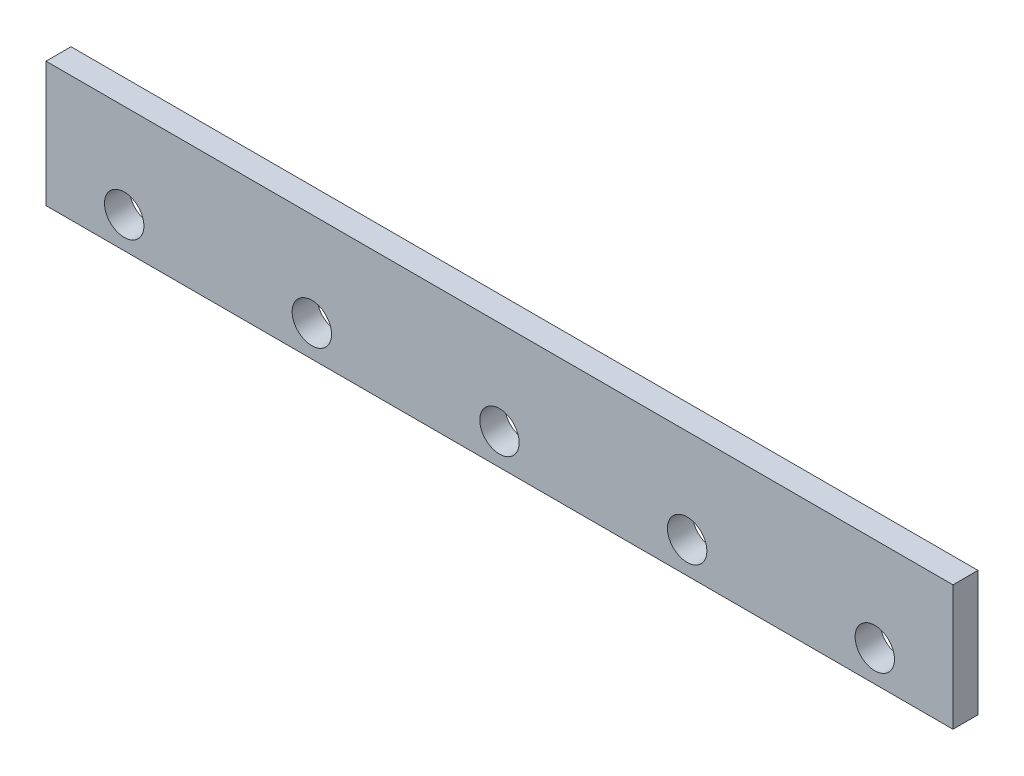
ISO-10303-21;
HEADER;
FILE_DESCRIPTION(('STEP AP214'),'2;1');
FILE_NAME('part.step','',(''),(''),'','','');
FILE_SCHEMA(('AUTOMOTIVE_DESIGN { 1 0 10303 214 1 1 1 1 }'));
ENDSEC;
DATA;
#1=APPLICATION_CONTEXT('core data for automotive mechanical design processes');
#2=APPLICATION_PROTOCOL_DEFINITION('international standard','automotive_design',2000,#1);
#3=PRODUCT_CONTEXT('',#1,'mechanical');
#4=PRODUCT('Part','Part','',(#3));
#5=PRODUCT_RELATED_PRODUCT_CATEGORY('part','',(#4));
#6=PRODUCT_DEFINITION_FORMATION('','',#4);
#7=PRODUCT_DEFINITION_CONTEXT('part definition',#1,'design');
#8=PRODUCT_DEFINITION('design','',#6,#7);
#9=PRODUCT_DEFINITION_SHAPE('','',#8);
#10=(LENGTH_UNIT() NAMED_UNIT(*) SI_UNIT(.MILLI.,.METRE.));
#11=(NAMED_UNIT(*) PLANE_ANGLE_UNIT() SI_UNIT($,.RADIAN.));
#12=(NAMED_UNIT(*) SI_UNIT($,.STERADIAN.) SOLID_ANGLE_UNIT());
#13=UNCERTAINTY_MEASURE_WITH_UNIT(LENGTH_MEASURE(1.E-05),#10,'distance_accuracy_value','');
#14=(GEOMETRIC_REPRESENTATION_CONTEXT(3) GLOBAL_UNCERTAINTY_ASSIGNED_CONTEXT((#13)) GLOBAL_UNIT_ASSIGNED_CONTEXT((#10,
#11,#12)) REPRESENTATION_CONTEXT('',''));
#15=CARTESIAN_POINT('',(0.,0.,0.));
#16=DIRECTION('',(0.,0.,1.));
#17=DIRECTION('',(1.,0.,0.));
#18=AXIS2_PLACEMENT_3D('',#15,#16,#17);
#19=CARTESIAN_POINT('',(0.,0.,16.));
#20=DIRECTION('',(0.,0.,-1.));
#21=DIRECTION('',(-1.,0.,0.));
#22=AXIS2_PLACEMENT_3D('',#19,#20,#21);
#23=PLANE('',#22);
#24=CARTESIAN_POINT('',(410.,20.,16.));
#25=DIRECTION('',(0.,0.,1.));
#26=DIRECTION('',(1.,0.,0.));
#27=AXIS2_PLACEMENT_3D('',#24,#25,#26);
#28=CIRCLE('',#27,12.6);
#29=CARTESIAN_POINT('',(422.6,20.,16.));
#30=VERTEX_POINT('',#29);
#31=EDGE_CURVE('E127',#30,#30,#28,.T.);
#32=ORIENTED_EDGE('',*,*,#31,.F.);
#33=EDGE_LOOP('',(#32));
#34=FACE_BOUND('',#33,.T.);
#35=CARTESIAN_POINT('',(170.,20.,16.));
#36=DIRECTION('',(0.,0.,1.));
#37=DIRECTION('',(1.,0.,0.));
#38=AXIS2_PLACEMENT_3D('',#35,#36,#37);
#39=CIRCLE('',#38,12.6);
#40=CARTESIAN_POINT('',(182.6,20.,16.));
#41=VERTEX_POINT('',#40);
#42=EDGE_CURVE('E115',#41,#41,#39,.T.);
#43=ORIENTED_EDGE('',*,*,#42,.F.);
#44=EDGE_LOOP('',(#43));
#45=FACE_BOUND('',#44,.T.);
#46=DIRECTION('',(0.,-1.,0.));
#47=VECTOR('',#46,1.);
#48=CARTESIAN_POINT('',(0.,0.,16.));
#49=LINE('',#48,#47);
#50=CARTESIAN_POINT('',(0.,80.,16.));
#51=VERTEX_POINT('',#50);
#52=CARTESIAN_POINT('',(0.,0.,16.));
#53=VERTEX_POINT('',#52);
#54=EDGE_CURVE('E85',#51,#53,#49,.T.);
#55=ORIENTED_EDGE('',*,*,#54,.T.);
#56=DIRECTION('',(1.,0.,0.));
#57=VECTOR('',#56,1.);
#58=CARTESIAN_POINT('',(0.,0.,16.));
#59=LINE('',#58,#57);
#60=CARTESIAN_POINT('',(580.,0.,16.));
#61=VERTEX_POINT('',#60);
#62=EDGE_CURVE('E80',#53,#61,#59,.T.);
#63=ORIENTED_EDGE('',*,*,#62,.T.);
#64=DIRECTION('',(0.,1.,0.));
#65=VECTOR('',#64,1.);
#66=CARTESIAN_POINT('',(580.,0.,16.));
#67=LINE('',#66,#65);
#68=CARTESIAN_POINT('',(580.,80.,16.));
#69=VERTEX_POINT('',#68);
#70=EDGE_CURVE('E83',#61,#69,#67,.T.);
#71=ORIENTED_EDGE('',*,*,#70,.T.);
#72=DIRECTION('',(-1.,0.,0.));
#73=VECTOR('',#72,1.);
#74=CARTESIAN_POINT('',(0.,80.,16.));
#75=LINE('',#74,#73);
#76=EDGE_CURVE('E50',#69,#51,#75,.T.);
#77=ORIENTED_EDGE('',*,*,#76,.T.);
#78=EDGE_LOOP('',(#55,#63,#71,#77));
#79=FACE_BOUND('',#78,.T.);
#80=CARTESIAN_POINT('',(50.,20.,16.));
#81=DIRECTION('',(0.,0.,1.));
#82=DIRECTION('',(1.,0.,0.));
#83=AXIS2_PLACEMENT_3D('',#80,#81,#82);
#84=CIRCLE('',#83,12.6);
#85=CARTESIAN_POINT('',(62.6,20.,16.));
#86=VERTEX_POINT('',#85);
#87=EDGE_CURVE('E100',#86,#86,#84,.T.);
#88=ORIENTED_EDGE('',*,*,#87,.F.);
#89=EDGE_LOOP('',(#88));
#90=FACE_BOUND('',#89,.T.);
#91=CARTESIAN_POINT('',(290.,20.,16.));
#92=DIRECTION('',(0.,0.,1.));
#93=DIRECTION('',(1.,0.,0.));
#94=AXIS2_PLACEMENT_3D('',#91,#92,#93);
#95=CIRCLE('',#94,12.6);
#96=CARTESIAN_POINT('',(302.6,20.,16.));
#97=VERTEX_POINT('',#96);
#98=EDGE_CURVE('E121',#97,#97,#95,.T.);
#99=ORIENTED_EDGE('',*,*,#98,.F.);
#100=EDGE_LOOP('',(#99));
#101=FACE_BOUND('',#100,.T.);
#102=CARTESIAN_POINT('',(530.,20.,16.));
#103=DIRECTION('',(0.,0.,1.));
#104=DIRECTION('',(1.,0.,0.));
#105=AXIS2_PLACEMENT_3D('',#102,#103,#104);
#106=CIRCLE('',#105,12.5999999999999);
#107=CARTESIAN_POINT('',(542.6,20.,16.));
#108=VERTEX_POINT('',#107);
#109=EDGE_CURVE('E133',#108,#108,#106,.T.);
#110=ORIENTED_EDGE('',*,*,#109,.F.);
#111=EDGE_LOOP('',(#110));
#112=FACE_BOUND('',#111,.T.);
#113=ADVANCED_FACE('F33',(#34,#45,#79,#90,#101,#112),#23,.F.);
#114=CARTESIAN_POINT('',(0.,0.,0.));
#115=DIRECTION('',(0.,0.,-1.));
#116=DIRECTION('',(-1.,0.,0.));
#117=AXIS2_PLACEMENT_3D('',#114,#115,#116);
#118=PLANE('',#117);
#119=CARTESIAN_POINT('',(410.,20.,0.));
#120=DIRECTION('',(0.,0.,1.));
#121=DIRECTION('',(1.,0.,0.));
#122=AXIS2_PLACEMENT_3D('',#119,#120,#121);
#123=CIRCLE('',#122,12.6);
#124=CARTESIAN_POINT('',(422.6,20.,0.));
#125=VERTEX_POINT('',#124);
#126=EDGE_CURVE('E130',#125,#125,#123,.T.);
#127=ORIENTED_EDGE('',*,*,#126,.T.);
#128=EDGE_LOOP('',(#127));
#129=FACE_BOUND('',#128,.T.);
#130=CARTESIAN_POINT('',(170.,20.,0.));
#131=DIRECTION('',(0.,0.,1.));
#132=DIRECTION('',(1.,0.,0.));
#133=AXIS2_PLACEMENT_3D('',#130,#131,#132);
#134=CIRCLE('',#133,12.6);
#135=CARTESIAN_POINT('',(182.6,20.,0.));
#136=VERTEX_POINT('',#135);
#137=EDGE_CURVE('E118',#136,#136,#134,.T.);
#138=ORIENTED_EDGE('',*,*,#137,.T.);
#139=EDGE_LOOP('',(#138));
#140=FACE_BOUND('',#139,.T.);
#141=DIRECTION('',(0.,-1.,0.));
#142=VECTOR('',#141,1.);
#143=CARTESIAN_POINT('',(0.,0.,0.));
#144=LINE('',#143,#142);
#145=CARTESIAN_POINT('',(0.,80.,0.));
#146=VERTEX_POINT('',#145);
#147=CARTESIAN_POINT('',(0.,0.,0.));
#148=VERTEX_POINT('',#147);
#149=EDGE_CURVE('E97',#146,#148,#144,.T.);
#150=ORIENTED_EDGE('',*,*,#149,.F.);
#151=DIRECTION('',(-1.,0.,0.));
#152=VECTOR('',#151,1.);
#153=CARTESIAN_POINT('',(0.,80.,0.));
#154=LINE('',#153,#152);
#155=CARTESIAN_POINT('',(580.,80.,0.));
#156=VERTEX_POINT('',#155);
#157=EDGE_CURVE('E73',#156,#146,#154,.T.);
#158=ORIENTED_EDGE('',*,*,#157,.F.);
#159=DIRECTION('',(0.,1.,0.));
#160=VECTOR('',#159,1.);
#161=CARTESIAN_POINT('',(580.,0.,0.));
#162=LINE('',#161,#160);
#163=CARTESIAN_POINT('',(580.,0.,0.));
#164=VERTEX_POINT('',#163);
#165=EDGE_CURVE('E67',#164,#156,#162,.T.);
#166=ORIENTED_EDGE('',*,*,#165,.F.);
#167=DIRECTION('',(1.,0.,0.));
#168=VECTOR('',#167,1.);
#169=CARTESIAN_POINT('',(0.,0.,0.));
#170=LINE('',#169,#168);
#171=EDGE_CURVE('E89',#148,#164,#170,.T.);
#172=ORIENTED_EDGE('',*,*,#171,.F.);
#173=EDGE_LOOP('',(#150,#158,#166,#172));
#174=FACE_BOUND('',#173,.T.);
#175=CARTESIAN_POINT('',(50.,20.,0.));
#176=DIRECTION('',(0.,0.,1.));
#177=DIRECTION('',(1.,0.,0.));
#178=AXIS2_PLACEMENT_3D('',#175,#176,#177);
#179=CIRCLE('',#178,12.6);
#180=CARTESIAN_POINT('',(62.6,20.,0.));
#181=VERTEX_POINT('',#180);
#182=EDGE_CURVE('E112',#181,#181,#179,.T.);
#183=ORIENTED_EDGE('',*,*,#182,.T.);
#184=EDGE_LOOP('',(#183));
#185=FACE_BOUND('',#184,.T.);
#186=CARTESIAN_POINT('',(290.,20.,0.));
#187=DIRECTION('',(0.,0.,1.));
#188=DIRECTION('',(1.,0.,0.));
#189=AXIS2_PLACEMENT_3D('',#186,#187,#188);
#190=CIRCLE('',#189,12.6);
#191=CARTESIAN_POINT('',(302.6,20.,0.));
#192=VERTEX_POINT('',#191);
#193=EDGE_CURVE('E124',#192,#192,#190,.T.);
#194=ORIENTED_EDGE('',*,*,#193,.T.);
#195=EDGE_LOOP('',(#194));
#196=FACE_BOUND('',#195,.T.);
#197=CARTESIAN_POINT('',(530.,20.,0.));
#198=DIRECTION('',(0.,0.,1.));
#199=DIRECTION('',(1.,0.,0.));
#200=AXIS2_PLACEMENT_3D('',#197,#198,#199);
#201=CIRCLE('',#200,12.5999999999999);
#202=CARTESIAN_POINT('',(542.6,20.,0.));
#203=VERTEX_POINT('',#202);
#204=EDGE_CURVE('E136',#203,#203,#201,.T.);
#205=ORIENTED_EDGE('',*,*,#204,.T.);
#206=EDGE_LOOP('',(#205));
#207=FACE_BOUND('',#206,.T.);
#208=ADVANCED_FACE('F108',(#129,#140,#174,#185,#196,#207),#118,.T.);
#209=CARTESIAN_POINT('',(0.,0.,16.));
#210=DIRECTION('',(1.,0.,0.));
#211=DIRECTION('',(0.,0.,-1.));
#212=AXIS2_PLACEMENT_3D('',#209,#210,#211);
#213=PLANE('',#212);
#214=ORIENTED_EDGE('',*,*,#149,.T.);
#215=DIRECTION('',(0.,0.,-1.));
#216=VECTOR('',#215,1.);
#217=CARTESIAN_POINT('',(0.,0.,16.));
#218=LINE('',#217,#216);
#219=EDGE_CURVE('E11',#53,#148,#218,.T.);
#220=ORIENTED_EDGE('',*,*,#219,.F.);
#221=ORIENTED_EDGE('',*,*,#54,.F.);
#222=DIRECTION('',(0.,0.,-1.));
#223=VECTOR('',#222,1.);
#224=CARTESIAN_POINT('',(0.,80.,16.));
#225=LINE('',#224,#223);
#226=EDGE_CURVE('E93',#51,#146,#225,.T.);
#227=ORIENTED_EDGE('',*,*,#226,.T.);
#228=EDGE_LOOP('',(#214,#220,#221,#227));
#229=FACE_BOUND('',#228,.T.);
#230=ADVANCED_FACE('F35',(#229),#213,.F.);
#231=CARTESIAN_POINT('',(0.,0.,16.));
#232=DIRECTION('',(0.,1.,0.));
#233=DIRECTION('',(0.,0.,1.));
#234=AXIS2_PLACEMENT_3D('',#231,#232,#233);
#235=PLANE('',#234);
#236=ORIENTED_EDGE('',*,*,#171,.T.);
#237=DIRECTION('',(0.,0.,-1.));
#238=VECTOR('',#237,1.);
#239=CARTESIAN_POINT('',(580.,0.,16.));
#240=LINE('',#239,#238);
#241=EDGE_CURVE('E42',#61,#164,#240,.T.);
#242=ORIENTED_EDGE('',*,*,#241,.F.);
#243=ORIENTED_EDGE('',*,*,#62,.F.);
#244=ORIENTED_EDGE('',*,*,#219,.T.);
#245=EDGE_LOOP('',(#236,#242,#243,#244));
#246=FACE_BOUND('',#245,.T.);
#247=ADVANCED_FACE('F88',(#246),#235,.F.);
#248=CARTESIAN_POINT('',(580.,0.,16.));
#249=DIRECTION('',(-1.,0.,0.));
#250=DIRECTION('',(0.,0.,1.));
#251=AXIS2_PLACEMENT_3D('',#248,#249,#250);
#252=PLANE('',#251);
#253=ORIENTED_EDGE('',*,*,#165,.T.);
#254=DIRECTION('',(0.,0.,-1.));
#255=VECTOR('',#254,1.);
#256=CARTESIAN_POINT('',(580.,80.,16.));
#257=LINE('',#256,#255);
#258=EDGE_CURVE('E90',#69,#156,#257,.T.);
#259=ORIENTED_EDGE('',*,*,#258,.F.);
#260=ORIENTED_EDGE('',*,*,#70,.F.);
#261=ORIENTED_EDGE('',*,*,#241,.T.);
#262=EDGE_LOOP('',(#253,#259,#260,#261));
#263=FACE_BOUND('',#262,.T.);
#264=ADVANCED_FACE('F91',(#263),#252,.F.);
#265=CARTESIAN_POINT('',(0.,80.,16.));
#266=DIRECTION('',(0.,-1.,0.));
#267=DIRECTION('',(0.,0.,-1.));
#268=AXIS2_PLACEMENT_3D('',#265,#266,#267);
#269=PLANE('',#268);
#270=ORIENTED_EDGE('',*,*,#157,.T.);
#271=ORIENTED_EDGE('',*,*,#226,.F.);
#272=ORIENTED_EDGE('',*,*,#76,.F.);
#273=ORIENTED_EDGE('',*,*,#258,.T.);
#274=EDGE_LOOP('',(#270,#271,#272,#273));
#275=FACE_BOUND('',#274,.T.);
#276=ADVANCED_FACE('F105',(#275),#269,.F.);
#277=CARTESIAN_POINT('',(50.,20.,16.));
#278=DIRECTION('',(0.,0.,-1.));
#279=DIRECTION('',(-1.,0.,0.));
#280=AXIS2_PLACEMENT_3D('',#277,#278,#279);
#281=CYLINDRICAL_SURFACE('',#280,12.6);
#282=ORIENTED_EDGE('',*,*,#87,.T.);
#283=EDGE_LOOP('',(#282));
#284=FACE_BOUND('',#283,.T.);
#285=ORIENTED_EDGE('',*,*,#182,.F.);
#286=EDGE_LOOP('',(#285));
#287=FACE_BOUND('',#286,.T.);
#288=ADVANCED_FACE('F156',(#284,#287),#281,.F.);
#289=CARTESIAN_POINT('',(170.,20.,16.));
#290=DIRECTION('',(0.,0.,-1.));
#291=DIRECTION('',(-1.,0.,0.));
#292=AXIS2_PLACEMENT_3D('',#289,#290,#291);
#293=CYLINDRICAL_SURFACE('',#292,12.6);
#294=ORIENTED_EDGE('',*,*,#42,.T.);
#295=EDGE_LOOP('',(#294));
#296=FACE_BOUND('',#295,.T.);
#297=ORIENTED_EDGE('',*,*,#137,.F.);
#298=EDGE_LOOP('',(#297));
#299=FACE_BOUND('',#298,.T.);
#300=ADVANCED_FACE('F202',(#296,#299),#293,.F.);
#301=CARTESIAN_POINT('',(290.,20.,16.));
#302=DIRECTION('',(0.,0.,-1.));
#303=DIRECTION('',(-1.,0.,0.));
#304=AXIS2_PLACEMENT_3D('',#301,#302,#303);
#305=CYLINDRICAL_SURFACE('',#304,12.6);
#306=ORIENTED_EDGE('',*,*,#98,.T.);
#307=EDGE_LOOP('',(#306));
#308=FACE_BOUND('',#307,.T.);
#309=ORIENTED_EDGE('',*,*,#193,.F.);
#310=EDGE_LOOP('',(#309));
#311=FACE_BOUND('',#310,.T.);
#312=ADVANCED_FACE('F210',(#308,#311),#305,.F.);
#313=CARTESIAN_POINT('',(410.,20.,16.));
#314=DIRECTION('',(0.,0.,-1.));
#315=DIRECTION('',(-1.,0.,0.));
#316=AXIS2_PLACEMENT_3D('',#313,#314,#315);
#317=CYLINDRICAL_SURFACE('',#316,12.6);
#318=ORIENTED_EDGE('',*,*,#31,.T.);
#319=EDGE_LOOP('',(#318));
#320=FACE_BOUND('',#319,.T.);
#321=ORIENTED_EDGE('',*,*,#126,.F.);
#322=EDGE_LOOP('',(#321));
#323=FACE_BOUND('',#322,.T.);
#324=ADVANCED_FACE('F218',(#320,#323),#317,.F.);
#325=CARTESIAN_POINT('',(530.,20.,16.));
#326=DIRECTION('',(0.,0.,-1.));
#327=DIRECTION('',(-1.,0.,0.));
#328=AXIS2_PLACEMENT_3D('',#325,#326,#327);
#329=CYLINDRICAL_SURFACE('',#328,12.5999999999999);
#330=ORIENTED_EDGE('',*,*,#109,.T.);
#331=EDGE_LOOP('',(#330));
#332=FACE_BOUND('',#331,.T.);
#333=ORIENTED_EDGE('',*,*,#204,.F.);
#334=EDGE_LOOP('',(#333));
#335=FACE_BOUND('',#334,.T.);
#336=ADVANCED_FACE('F142',(#332,#335),#329,.F.);
#337=CLOSED_SHELL('',(#113,#208,#230,#247,#264,#276,#288,#300,#312,#324,#336));
#338=MANIFOLD_SOLID_BREP('B2',#337);
#339=ADVANCED_BREP_SHAPE_REPRESENTATION('',(#18,#338),#14);
#340=SHAPE_DEFINITION_REPRESENTATION(#9,#339);
ENDSEC;
END-ISO-10303-21;
